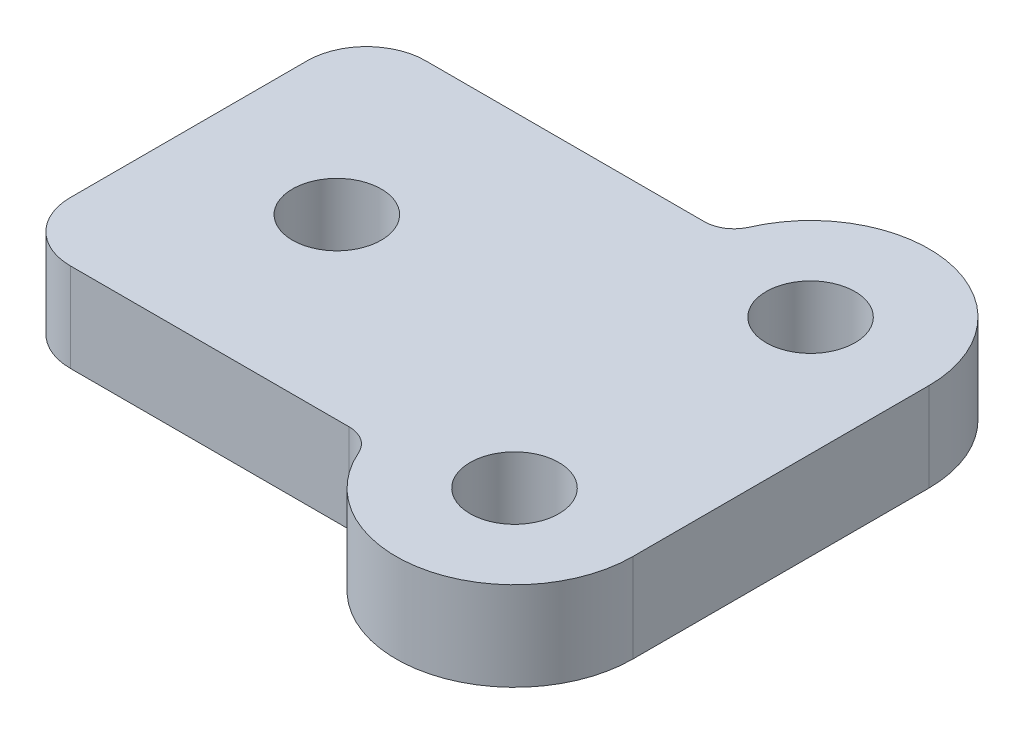
ISO-10303-21;
HEADER;
FILE_DESCRIPTION(('STEP AP214'),'2;1');
FILE_NAME('part.step','',(''),(''),'','','');
FILE_SCHEMA(('AUTOMOTIVE_DESIGN { 1 0 10303 214 1 1 1 1 }'));
ENDSEC;
DATA;
#1=APPLICATION_CONTEXT('core data for automotive mechanical design processes');
#2=APPLICATION_PROTOCOL_DEFINITION('international standard','automotive_design',2000,#1);
#3=PRODUCT_CONTEXT('',#1,'mechanical');
#4=PRODUCT('Part','Part','',(#3));
#5=PRODUCT_RELATED_PRODUCT_CATEGORY('part','',(#4));
#6=PRODUCT_DEFINITION_FORMATION('','',#4);
#7=PRODUCT_DEFINITION_CONTEXT('part definition',#1,'design');
#8=PRODUCT_DEFINITION('design','',#6,#7);
#9=PRODUCT_DEFINITION_SHAPE('','',#8);
#10=(LENGTH_UNIT() NAMED_UNIT(*) SI_UNIT(.MILLI.,.METRE.));
#11=(NAMED_UNIT(*) PLANE_ANGLE_UNIT() SI_UNIT($,.RADIAN.));
#12=(NAMED_UNIT(*) SI_UNIT($,.STERADIAN.) SOLID_ANGLE_UNIT());
#13=UNCERTAINTY_MEASURE_WITH_UNIT(LENGTH_MEASURE(1.E-05),#10,'distance_accuracy_value','');
#14=(GEOMETRIC_REPRESENTATION_CONTEXT(3) GLOBAL_UNCERTAINTY_ASSIGNED_CONTEXT((#13)) GLOBAL_UNIT_ASSIGNED_CONTEXT((#10,
#11,#12)) REPRESENTATION_CONTEXT('',''));
#15=CARTESIAN_POINT('',(0.,0.,0.));
#16=DIRECTION('',(0.,0.,1.));
#17=DIRECTION('',(1.,0.,0.));
#18=AXIS2_PLACEMENT_3D('',#15,#16,#17);
#19=CARTESIAN_POINT('',(-3.,3.,-4.));
#20=DIRECTION('',(0.,1.,0.));
#21=DIRECTION('',(0.,0.,1.));
#22=AXIS2_PLACEMENT_3D('',#19,#20,#21);
#23=PLANE('',#22);
#24=CARTESIAN_POINT('',(11.,3.,-5.));
#25=DIRECTION('',(0.,1.,0.));
#26=DIRECTION('',(0.,0.,1.));
#27=AXIS2_PLACEMENT_3D('',#24,#25,#26);
#28=CIRCLE('',#27,1.5);
#29=CARTESIAN_POINT('',(11.,3.,-3.5));
#30=VERTEX_POINT('',#29);
#31=EDGE_CURVE('E253',#30,#30,#28,.T.);
#32=ORIENTED_EDGE('',*,*,#31,.F.);
#33=EDGE_LOOP('',(#32));
#34=FACE_BOUND('',#33,.T.);
#35=CARTESIAN_POINT('',(-3.,3.,-4.));
#36=DIRECTION('',(0.,1.,0.));
#37=DIRECTION('',(0.,0.,1.));
#38=AXIS2_PLACEMENT_3D('',#35,#36,#37);
#39=CIRCLE('',#38,2.);
#40=CARTESIAN_POINT('',(-3.,3.,-6.));
#41=VERTEX_POINT('',#40);
#42=CARTESIAN_POINT('',(-5.,3.,-4.));
#43=VERTEX_POINT('',#42);
#44=EDGE_CURVE('E186',#41,#43,#39,.T.);
#45=ORIENTED_EDGE('',*,*,#44,.T.);
#46=DIRECTION('',(0.,0.,1.));
#47=VECTOR('',#46,1.);
#48=CARTESIAN_POINT('',(-5.,3.,-4.));
#49=LINE('',#48,#47);
#50=CARTESIAN_POINT('',(-5.,3.,4.));
#51=VERTEX_POINT('',#50);
#52=EDGE_CURVE('E110',#43,#51,#49,.T.);
#53=ORIENTED_EDGE('',*,*,#52,.T.);
#54=CARTESIAN_POINT('',(-3.,3.,4.));
#55=DIRECTION('',(0.,1.,0.));
#56=DIRECTION('',(0.,0.,1.));
#57=AXIS2_PLACEMENT_3D('',#54,#55,#56);
#58=CIRCLE('',#57,2.);
#59=CARTESIAN_POINT('',(-3.,3.,6.));
#60=VERTEX_POINT('',#59);
#61=EDGE_CURVE('E215',#51,#60,#58,.T.);
#62=ORIENTED_EDGE('',*,*,#61,.T.);
#63=DIRECTION('',(1.,0.,0.));
#64=VECTOR('',#63,1.);
#65=CARTESIAN_POINT('',(-3.,3.,6.));
#66=LINE('',#65,#64);
#67=CARTESIAN_POINT('',(6.41742430504416,3.,6.));
#68=VERTEX_POINT('',#67);
#69=EDGE_CURVE('E235',#60,#68,#66,.T.);
#70=ORIENTED_EDGE('',*,*,#69,.T.);
#71=CARTESIAN_POINT('',(6.41742430504416,3.,7.));
#72=DIRECTION('',(0.,-1.,0.));
#73=DIRECTION('',(0.,0.,1.));
#74=AXIS2_PLACEMENT_3D('',#71,#72,#73);
#75=CIRCLE('',#74,1.);
#76=CARTESIAN_POINT('',(7.33393944403533,3.,6.6));
#77=VERTEX_POINT('',#76);
#78=EDGE_CURVE('E231',#68,#77,#75,.T.);
#79=ORIENTED_EDGE('',*,*,#78,.T.);
#80=CARTESIAN_POINT('',(11.,3.,5.));
#81=DIRECTION('',(0.,1.,0.));
#82=DIRECTION('',(0.,0.,1.));
#83=AXIS2_PLACEMENT_3D('',#80,#81,#82);
#84=CIRCLE('',#83,4.);
#85=CARTESIAN_POINT('',(15.,3.,5.));
#86=VERTEX_POINT('',#85);
#87=EDGE_CURVE('E234',#77,#86,#84,.T.);
#88=ORIENTED_EDGE('',*,*,#87,.T.);
#89=DIRECTION('',(0.,0.,-1.));
#90=VECTOR('',#89,1.);
#91=CARTESIAN_POINT('',(15.,3.,-5.));
#92=LINE('',#91,#90);
#93=CARTESIAN_POINT('',(15.,3.,-5.));
#94=VERTEX_POINT('',#93);
#95=EDGE_CURVE('E135',#86,#94,#92,.T.);
#96=ORIENTED_EDGE('',*,*,#95,.T.);
#97=CARTESIAN_POINT('',(11.,3.,-5.));
#98=DIRECTION('',(0.,1.,0.));
#99=DIRECTION('',(0.,0.,1.));
#100=AXIS2_PLACEMENT_3D('',#97,#98,#99);
#101=CIRCLE('',#100,4.);
#102=CARTESIAN_POINT('',(7.33393944403533,3.,-6.6));
#103=VERTEX_POINT('',#102);
#104=EDGE_CURVE('E129',#94,#103,#101,.T.);
#105=ORIENTED_EDGE('',*,*,#104,.T.);
#106=CARTESIAN_POINT('',(6.41742430504416,3.,-7.));
#107=DIRECTION('',(0.,-1.,0.));
#108=DIRECTION('',(0.,0.,1.));
#109=AXIS2_PLACEMENT_3D('',#106,#107,#108);
#110=CIRCLE('',#109,0.999999999999999);
#111=CARTESIAN_POINT('',(6.41742430504416,3.,-6.));
#112=VERTEX_POINT('',#111);
#113=EDGE_CURVE('E133',#103,#112,#110,.T.);
#114=ORIENTED_EDGE('',*,*,#113,.T.);
#115=DIRECTION('',(-1.,0.,0.));
#116=VECTOR('',#115,1.);
#117=CARTESIAN_POINT('',(-3.,3.,-6.));
#118=LINE('',#117,#116);
#119=EDGE_CURVE('E61',#112,#41,#118,.T.);
#120=ORIENTED_EDGE('',*,*,#119,.T.);
#121=EDGE_LOOP('',(#45,#53,#62,#70,#79,#88,#96,#105,#114,#120));
#122=FACE_BOUND('',#121,.T.);
#123=CARTESIAN_POINT('',(0.,3.,0.));
#124=DIRECTION('',(0.,1.,0.));
#125=DIRECTION('',(0.,0.,1.));
#126=AXIS2_PLACEMENT_3D('',#123,#124,#125);
#127=CIRCLE('',#126,1.5);
#128=CARTESIAN_POINT('',(0.,3.,1.5));
#129=VERTEX_POINT('',#128);
#130=EDGE_CURVE('E162',#129,#129,#127,.T.);
#131=ORIENTED_EDGE('',*,*,#130,.F.);
#132=EDGE_LOOP('',(#131));
#133=FACE_BOUND('',#132,.T.);
#134=CARTESIAN_POINT('',(11.,3.,5.));
#135=DIRECTION('',(0.,1.,0.));
#136=DIRECTION('',(0.,0.,1.));
#137=AXIS2_PLACEMENT_3D('',#134,#135,#136);
#138=CIRCLE('',#137,1.5);
#139=CARTESIAN_POINT('',(11.,3.,6.5));
#140=VERTEX_POINT('',#139);
#141=EDGE_CURVE('E261',#140,#140,#138,.T.);
#142=ORIENTED_EDGE('',*,*,#141,.F.);
#143=EDGE_LOOP('',(#142));
#144=FACE_BOUND('',#143,.T.);
#145=ADVANCED_FACE('F43',(#34,#122,#133,#144),#23,.T.);
#146=CARTESIAN_POINT('',(-3.,0.,-4.));
#147=DIRECTION('',(0.,1.,0.));
#148=DIRECTION('',(0.,0.,1.));
#149=AXIS2_PLACEMENT_3D('',#146,#147,#148);
#150=PLANE('',#149);
#151=CARTESIAN_POINT('',(-3.,0.,-4.));
#152=DIRECTION('',(0.,1.,0.));
#153=DIRECTION('',(0.,0.,1.));
#154=AXIS2_PLACEMENT_3D('',#151,#152,#153);
#155=CIRCLE('',#154,2.);
#156=CARTESIAN_POINT('',(-3.,0.,-6.));
#157=VERTEX_POINT('',#156);
#158=CARTESIAN_POINT('',(-5.,0.,-4.));
#159=VERTEX_POINT('',#158);
#160=EDGE_CURVE('E157',#157,#159,#155,.T.);
#161=ORIENTED_EDGE('',*,*,#160,.F.);
#162=DIRECTION('',(-1.,0.,0.));
#163=VECTOR('',#162,1.);
#164=CARTESIAN_POINT('',(-3.,0.,-6.));
#165=LINE('',#164,#163);
#166=CARTESIAN_POINT('',(6.41742430504416,0.,-6.));
#167=VERTEX_POINT('',#166);
#168=EDGE_CURVE('E102',#167,#157,#165,.T.);
#169=ORIENTED_EDGE('',*,*,#168,.F.);
#170=CARTESIAN_POINT('',(6.41742430504416,0.,-7.));
#171=DIRECTION('',(0.,-1.,0.));
#172=DIRECTION('',(0.,0.,1.));
#173=AXIS2_PLACEMENT_3D('',#170,#171,#172);
#174=CIRCLE('',#173,0.999999999999999);
#175=CARTESIAN_POINT('',(7.33393944403533,0.,-6.6));
#176=VERTEX_POINT('',#175);
#177=EDGE_CURVE('E96',#176,#167,#174,.T.);
#178=ORIENTED_EDGE('',*,*,#177,.F.);
#179=CARTESIAN_POINT('',(11.,0.,-5.));
#180=DIRECTION('',(0.,1.,0.));
#181=DIRECTION('',(0.,0.,1.));
#182=AXIS2_PLACEMENT_3D('',#179,#180,#181);
#183=CIRCLE('',#182,4.);
#184=CARTESIAN_POINT('',(15.,0.,-5.));
#185=VERTEX_POINT('',#184);
#186=EDGE_CURVE('E144',#185,#176,#183,.T.);
#187=ORIENTED_EDGE('',*,*,#186,.F.);
#188=DIRECTION('',(0.,0.,-1.));
#189=VECTOR('',#188,1.);
#190=CARTESIAN_POINT('',(15.,0.,-5.));
#191=LINE('',#190,#189);
#192=CARTESIAN_POINT('',(15.,0.,5.));
#193=VERTEX_POINT('',#192);
#194=EDGE_CURVE('E177',#193,#185,#191,.T.);
#195=ORIENTED_EDGE('',*,*,#194,.F.);
#196=CARTESIAN_POINT('',(11.,0.,5.));
#197=DIRECTION('',(0.,1.,0.));
#198=DIRECTION('',(0.,0.,1.));
#199=AXIS2_PLACEMENT_3D('',#196,#197,#198);
#200=CIRCLE('',#199,4.);
#201=CARTESIAN_POINT('',(7.33393944403533,0.,6.6));
#202=VERTEX_POINT('',#201);
#203=EDGE_CURVE('E174',#202,#193,#200,.T.);
#204=ORIENTED_EDGE('',*,*,#203,.F.);
#205=CARTESIAN_POINT('',(6.41742430504416,0.,7.));
#206=DIRECTION('',(0.,-1.,0.));
#207=DIRECTION('',(0.,0.,1.));
#208=AXIS2_PLACEMENT_3D('',#205,#206,#207);
#209=CIRCLE('',#208,1.);
#210=CARTESIAN_POINT('',(6.41742430504416,0.,6.));
#211=VERTEX_POINT('',#210);
#212=EDGE_CURVE('E171',#211,#202,#209,.T.);
#213=ORIENTED_EDGE('',*,*,#212,.F.);
#214=DIRECTION('',(1.,0.,0.));
#215=VECTOR('',#214,1.);
#216=CARTESIAN_POINT('',(-3.,0.,6.));
#217=LINE('',#216,#215);
#218=CARTESIAN_POINT('',(-3.,0.,6.));
#219=VERTEX_POINT('',#218);
#220=EDGE_CURVE('E168',#219,#211,#217,.T.);
#221=ORIENTED_EDGE('',*,*,#220,.F.);
#222=CARTESIAN_POINT('',(-3.,0.,4.));
#223=DIRECTION('',(0.,1.,0.));
#224=DIRECTION('',(0.,0.,1.));
#225=AXIS2_PLACEMENT_3D('',#222,#223,#224);
#226=CIRCLE('',#225,2.);
#227=CARTESIAN_POINT('',(-5.,0.,4.));
#228=VERTEX_POINT('',#227);
#229=EDGE_CURVE('E165',#228,#219,#226,.T.);
#230=ORIENTED_EDGE('',*,*,#229,.F.);
#231=DIRECTION('',(0.,0.,1.));
#232=VECTOR('',#231,1.);
#233=CARTESIAN_POINT('',(-5.,0.,-4.));
#234=LINE('',#233,#232);
#235=EDGE_CURVE('E161',#159,#228,#234,.T.);
#236=ORIENTED_EDGE('',*,*,#235,.F.);
#237=EDGE_LOOP('',(#161,#169,#178,#187,#195,#204,#213,#221,#230,#236));
#238=FACE_BOUND('',#237,.T.);
#239=CARTESIAN_POINT('',(0.,0.,0.));
#240=DIRECTION('',(0.,1.,0.));
#241=DIRECTION('',(0.,0.,1.));
#242=AXIS2_PLACEMENT_3D('',#239,#240,#241);
#243=CIRCLE('',#242,1.5);
#244=CARTESIAN_POINT('',(0.,0.,1.5));
#245=VERTEX_POINT('',#244);
#246=EDGE_CURVE('E249',#245,#245,#243,.T.);
#247=ORIENTED_EDGE('',*,*,#246,.T.);
#248=EDGE_LOOP('',(#247));
#249=FACE_BOUND('',#248,.T.);
#250=CARTESIAN_POINT('',(11.,0.,-5.));
#251=DIRECTION('',(0.,1.,0.));
#252=DIRECTION('',(0.,0.,1.));
#253=AXIS2_PLACEMENT_3D('',#250,#251,#252);
#254=CIRCLE('',#253,1.5);
#255=CARTESIAN_POINT('',(11.,0.,-3.5));
#256=VERTEX_POINT('',#255);
#257=EDGE_CURVE('E257',#256,#256,#254,.T.);
#258=ORIENTED_EDGE('',*,*,#257,.T.);
#259=EDGE_LOOP('',(#258));
#260=FACE_BOUND('',#259,.T.);
#261=CARTESIAN_POINT('',(11.,0.,5.));
#262=DIRECTION('',(0.,1.,0.));
#263=DIRECTION('',(0.,0.,1.));
#264=AXIS2_PLACEMENT_3D('',#261,#262,#263);
#265=CIRCLE('',#264,1.5);
#266=CARTESIAN_POINT('',(11.,0.,6.5));
#267=VERTEX_POINT('',#266);
#268=EDGE_CURVE('E265',#267,#267,#265,.T.);
#269=ORIENTED_EDGE('',*,*,#268,.T.);
#270=EDGE_LOOP('',(#269));
#271=FACE_BOUND('',#270,.T.);
#272=ADVANCED_FACE('F219',(#238,#249,#260,#271),#150,.F.);
#273=CARTESIAN_POINT('',(-3.,3.,-4.));
#274=DIRECTION('',(0.,-1.,0.));
#275=DIRECTION('',(0.,0.,-1.));
#276=AXIS2_PLACEMENT_3D('',#273,#274,#275);
#277=CYLINDRICAL_SURFACE('',#276,2.);
#278=ORIENTED_EDGE('',*,*,#160,.T.);
#279=DIRECTION('',(0.,-1.,0.));
#280=VECTOR('',#279,1.);
#281=CARTESIAN_POINT('',(-5.,3.,-4.));
#282=LINE('',#281,#280);
#283=EDGE_CURVE('E11',#43,#159,#282,.T.);
#284=ORIENTED_EDGE('',*,*,#283,.F.);
#285=ORIENTED_EDGE('',*,*,#44,.F.);
#286=DIRECTION('',(0.,-1.,0.));
#287=VECTOR('',#286,1.);
#288=CARTESIAN_POINT('',(-3.,3.,-6.));
#289=LINE('',#288,#287);
#290=EDGE_CURVE('E153',#41,#157,#289,.T.);
#291=ORIENTED_EDGE('',*,*,#290,.T.);
#292=EDGE_LOOP('',(#278,#284,#285,#291));
#293=FACE_BOUND('',#292,.T.);
#294=ADVANCED_FACE('F45',(#293),#277,.T.);
#295=CARTESIAN_POINT('',(-5.,3.,-4.));
#296=DIRECTION('',(1.,0.,0.));
#297=DIRECTION('',(0.,0.,-1.));
#298=AXIS2_PLACEMENT_3D('',#295,#296,#297);
#299=PLANE('',#298);
#300=ORIENTED_EDGE('',*,*,#235,.T.);
#301=DIRECTION('',(0.,-1.,0.));
#302=VECTOR('',#301,1.);
#303=CARTESIAN_POINT('',(-5.,3.,4.));
#304=LINE('',#303,#302);
#305=EDGE_CURVE('E53',#51,#228,#304,.T.);
#306=ORIENTED_EDGE('',*,*,#305,.F.);
#307=ORIENTED_EDGE('',*,*,#52,.F.);
#308=ORIENTED_EDGE('',*,*,#283,.T.);
#309=EDGE_LOOP('',(#300,#306,#307,#308));
#310=FACE_BOUND('',#309,.T.);
#311=ADVANCED_FACE('F308',(#310),#299,.F.);
#312=CARTESIAN_POINT('',(-3.,3.,4.));
#313=DIRECTION('',(0.,-1.,0.));
#314=DIRECTION('',(0.,0.,-1.));
#315=AXIS2_PLACEMENT_3D('',#312,#313,#314);
#316=CYLINDRICAL_SURFACE('',#315,2.);
#317=ORIENTED_EDGE('',*,*,#229,.T.);
#318=DIRECTION('',(0.,-1.,0.));
#319=VECTOR('',#318,1.);
#320=CARTESIAN_POINT('',(-3.,3.,6.));
#321=LINE('',#320,#319);
#322=EDGE_CURVE('E205',#60,#219,#321,.T.);
#323=ORIENTED_EDGE('',*,*,#322,.F.);
#324=ORIENTED_EDGE('',*,*,#61,.F.);
#325=ORIENTED_EDGE('',*,*,#305,.T.);
#326=EDGE_LOOP('',(#317,#323,#324,#325));
#327=FACE_BOUND('',#326,.T.);
#328=ADVANCED_FACE('F213',(#327),#316,.T.);
#329=CARTESIAN_POINT('',(-3.,3.,6.));
#330=DIRECTION('',(0.,0.,-1.));
#331=DIRECTION('',(-1.,0.,0.));
#332=AXIS2_PLACEMENT_3D('',#329,#330,#331);
#333=PLANE('',#332);
#334=ORIENTED_EDGE('',*,*,#220,.T.);
#335=DIRECTION('',(0.,-1.,0.));
#336=VECTOR('',#335,1.);
#337=CARTESIAN_POINT('',(6.41742430504416,3.,6.));
#338=LINE('',#337,#336);
#339=EDGE_CURVE('E201',#68,#211,#338,.T.);
#340=ORIENTED_EDGE('',*,*,#339,.F.);
#341=ORIENTED_EDGE('',*,*,#69,.F.);
#342=ORIENTED_EDGE('',*,*,#322,.T.);
#343=EDGE_LOOP('',(#334,#340,#341,#342));
#344=FACE_BOUND('',#343,.T.);
#345=ADVANCED_FACE('F225',(#344),#333,.F.);
#346=CARTESIAN_POINT('',(6.41742430504416,3.,7.));
#347=DIRECTION('',(0.,-1.,0.));
#348=DIRECTION('',(0.,0.,-1.));
#349=AXIS2_PLACEMENT_3D('',#346,#347,#348);
#350=CYLINDRICAL_SURFACE('',#349,1.);
#351=ORIENTED_EDGE('',*,*,#212,.T.);
#352=DIRECTION('',(0.,-1.,0.));
#353=VECTOR('',#352,1.);
#354=CARTESIAN_POINT('',(7.33393944403533,3.,6.6));
#355=LINE('',#354,#353);
#356=EDGE_CURVE('E197',#77,#202,#355,.T.);
#357=ORIENTED_EDGE('',*,*,#356,.F.);
#358=ORIENTED_EDGE('',*,*,#78,.F.);
#359=ORIENTED_EDGE('',*,*,#339,.T.);
#360=EDGE_LOOP('',(#351,#357,#358,#359));
#361=FACE_BOUND('',#360,.T.);
#362=ADVANCED_FACE('F229',(#361),#350,.F.);
#363=CARTESIAN_POINT('',(11.,3.,5.));
#364=DIRECTION('',(0.,-1.,0.));
#365=DIRECTION('',(0.,0.,-1.));
#366=AXIS2_PLACEMENT_3D('',#363,#364,#365);
#367=CYLINDRICAL_SURFACE('',#366,4.);
#368=ORIENTED_EDGE('',*,*,#203,.T.);
#369=DIRECTION('',(0.,-1.,0.));
#370=VECTOR('',#369,1.);
#371=CARTESIAN_POINT('',(15.,3.,5.));
#372=LINE('',#371,#370);
#373=EDGE_CURVE('E193',#86,#193,#372,.T.);
#374=ORIENTED_EDGE('',*,*,#373,.F.);
#375=ORIENTED_EDGE('',*,*,#87,.F.);
#376=ORIENTED_EDGE('',*,*,#356,.T.);
#377=EDGE_LOOP('',(#368,#374,#375,#376));
#378=FACE_BOUND('',#377,.T.);
#379=ADVANCED_FACE('F298',(#378),#367,.T.);
#380=CARTESIAN_POINT('',(15.,3.,-5.));
#381=DIRECTION('',(-1.,0.,0.));
#382=DIRECTION('',(0.,0.,1.));
#383=AXIS2_PLACEMENT_3D('',#380,#381,#382);
#384=PLANE('',#383);
#385=ORIENTED_EDGE('',*,*,#194,.T.);
#386=DIRECTION('',(0.,-1.,0.));
#387=VECTOR('',#386,1.);
#388=CARTESIAN_POINT('',(15.,3.,-5.));
#389=LINE('',#388,#387);
#390=EDGE_CURVE('E146',#94,#185,#389,.T.);
#391=ORIENTED_EDGE('',*,*,#390,.F.);
#392=ORIENTED_EDGE('',*,*,#95,.F.);
#393=ORIENTED_EDGE('',*,*,#373,.T.);
#394=EDGE_LOOP('',(#385,#391,#392,#393));
#395=FACE_BOUND('',#394,.T.);
#396=ADVANCED_FACE('F295',(#395),#384,.F.);
#397=CARTESIAN_POINT('',(11.,3.,-5.));
#398=DIRECTION('',(0.,-1.,0.));
#399=DIRECTION('',(0.,0.,-1.));
#400=AXIS2_PLACEMENT_3D('',#397,#398,#399);
#401=CYLINDRICAL_SURFACE('',#400,4.);
#402=ORIENTED_EDGE('',*,*,#186,.T.);
#403=DIRECTION('',(0.,-1.,0.));
#404=VECTOR('',#403,1.);
#405=CARTESIAN_POINT('',(7.33393944403533,3.,-6.6));
#406=LINE('',#405,#404);
#407=EDGE_CURVE('E141',#103,#176,#406,.T.);
#408=ORIENTED_EDGE('',*,*,#407,.F.);
#409=ORIENTED_EDGE('',*,*,#104,.F.);
#410=ORIENTED_EDGE('',*,*,#390,.T.);
#411=EDGE_LOOP('',(#402,#408,#409,#410));
#412=FACE_BOUND('',#411,.T.);
#413=ADVANCED_FACE('F142',(#412),#401,.T.);
#414=CARTESIAN_POINT('',(6.41742430504416,3.,-7.));
#415=DIRECTION('',(0.,-1.,0.));
#416=DIRECTION('',(0.,0.,-1.));
#417=AXIS2_PLACEMENT_3D('',#414,#415,#416);
#418=CYLINDRICAL_SURFACE('',#417,0.999999999999999);
#419=ORIENTED_EDGE('',*,*,#177,.T.);
#420=DIRECTION('',(0.,-1.,0.));
#421=VECTOR('',#420,1.);
#422=CARTESIAN_POINT('',(6.41742430504416,3.,-6.));
#423=LINE('',#422,#421);
#424=EDGE_CURVE('E147',#112,#167,#423,.T.);
#425=ORIENTED_EDGE('',*,*,#424,.F.);
#426=ORIENTED_EDGE('',*,*,#113,.F.);
#427=ORIENTED_EDGE('',*,*,#407,.T.);
#428=EDGE_LOOP('',(#419,#425,#426,#427));
#429=FACE_BOUND('',#428,.T.);
#430=ADVANCED_FACE('F149',(#429),#418,.F.);
#431=CARTESIAN_POINT('',(-3.,3.,-6.));
#432=DIRECTION('',(0.,0.,1.));
#433=DIRECTION('',(1.,0.,0.));
#434=AXIS2_PLACEMENT_3D('',#431,#432,#433);
#435=PLANE('',#434);
#436=ORIENTED_EDGE('',*,*,#168,.T.);
#437=ORIENTED_EDGE('',*,*,#290,.F.);
#438=ORIENTED_EDGE('',*,*,#119,.F.);
#439=ORIENTED_EDGE('',*,*,#424,.T.);
#440=EDGE_LOOP('',(#436,#437,#438,#439));
#441=FACE_BOUND('',#440,.T.);
#442=ADVANCED_FACE('F288',(#441),#435,.F.);
#443=CARTESIAN_POINT('',(0.,3.,0.));
#444=DIRECTION('',(0.,-1.,0.));
#445=DIRECTION('',(0.,0.,-1.));
#446=AXIS2_PLACEMENT_3D('',#443,#444,#445);
#447=CYLINDRICAL_SURFACE('',#446,1.5);
#448=ORIENTED_EDGE('',*,*,#130,.T.);
#449=EDGE_LOOP('',(#448));
#450=FACE_BOUND('',#449,.T.);
#451=ORIENTED_EDGE('',*,*,#246,.F.);
#452=EDGE_LOOP('',(#451));
#453=FACE_BOUND('',#452,.T.);
#454=ADVANCED_FACE('F285',(#450,#453),#447,.F.);
#455=CARTESIAN_POINT('',(11.,3.,-5.));
#456=DIRECTION('',(0.,-1.,0.));
#457=DIRECTION('',(0.,0.,-1.));
#458=AXIS2_PLACEMENT_3D('',#455,#456,#457);
#459=CYLINDRICAL_SURFACE('',#458,1.5);
#460=ORIENTED_EDGE('',*,*,#31,.T.);
#461=EDGE_LOOP('',(#460));
#462=FACE_BOUND('',#461,.T.);
#463=ORIENTED_EDGE('',*,*,#257,.F.);
#464=EDGE_LOOP('',(#463));
#465=FACE_BOUND('',#464,.T.);
#466=ADVANCED_FACE('F398',(#462,#465),#459,.F.);
#467=CARTESIAN_POINT('',(11.,3.,5.));
#468=DIRECTION('',(0.,-1.,0.));
#469=DIRECTION('',(0.,0.,-1.));
#470=AXIS2_PLACEMENT_3D('',#467,#468,#469);
#471=CYLINDRICAL_SURFACE('',#470,1.5);
#472=ORIENTED_EDGE('',*,*,#141,.T.);
#473=EDGE_LOOP('',(#472));
#474=FACE_BOUND('',#473,.T.);
#475=ORIENTED_EDGE('',*,*,#268,.F.);
#476=EDGE_LOOP('',(#475));
#477=FACE_BOUND('',#476,.T.);
#478=ADVANCED_FACE('F273',(#474,#477),#471,.F.);
#479=CLOSED_SHELL('',(#145,#272,#294,#311,#328,#345,#362,#379,#396,#413,#430,#442,#454,#466,#478));
#480=MANIFOLD_SOLID_BREP('B2',#479);
#481=ADVANCED_BREP_SHAPE_REPRESENTATION('',(#18,#480),#14);
#482=SHAPE_DEFINITION_REPRESENTATION(#9,#481);
ENDSEC;
END-ISO-10303-21;
